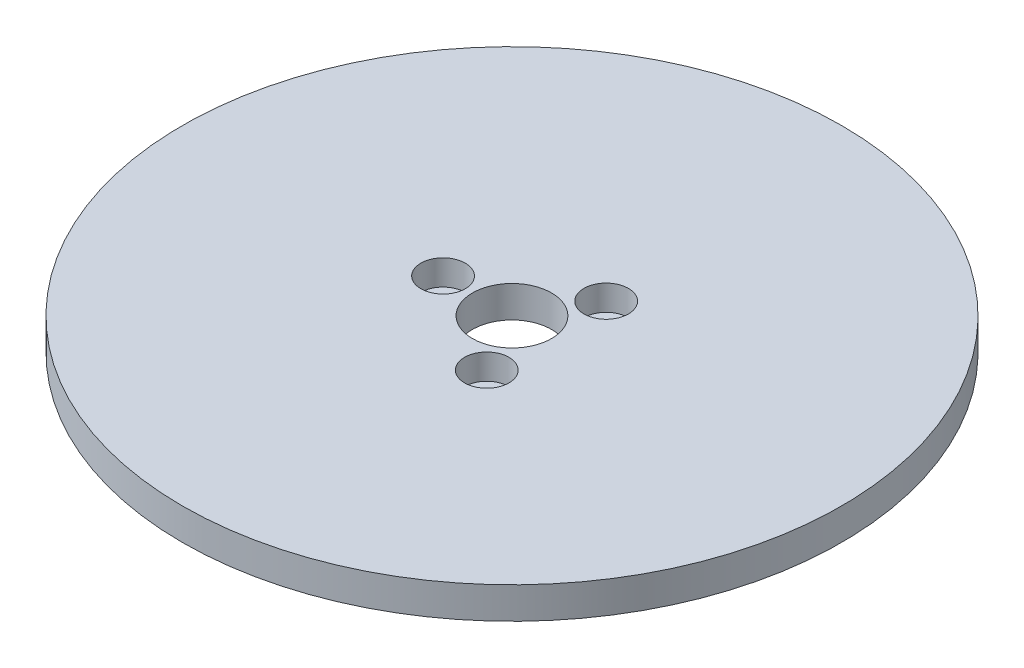
ISO-10303-21;
HEADER;
FILE_DESCRIPTION(('STEP AP214'),'2;1');
FILE_NAME('part.step','',(''),(''),'','','');
FILE_SCHEMA(('AUTOMOTIVE_DESIGN { 1 0 10303 214 1 1 1 1 }'));
ENDSEC;
DATA;
#1=APPLICATION_CONTEXT('core data for automotive mechanical design processes');
#2=APPLICATION_PROTOCOL_DEFINITION('international standard','automotive_design',2000,#1);
#3=PRODUCT_CONTEXT('',#1,'mechanical');
#4=PRODUCT('Part','Part','',(#3));
#5=PRODUCT_RELATED_PRODUCT_CATEGORY('part','',(#4));
#6=PRODUCT_DEFINITION_FORMATION('','',#4);
#7=PRODUCT_DEFINITION_CONTEXT('part definition',#1,'design');
#8=PRODUCT_DEFINITION('design','',#6,#7);
#9=PRODUCT_DEFINITION_SHAPE('','',#8);
#10=(LENGTH_UNIT() NAMED_UNIT(*) SI_UNIT(.MILLI.,.METRE.));
#11=(NAMED_UNIT(*) PLANE_ANGLE_UNIT() SI_UNIT($,.RADIAN.));
#12=(NAMED_UNIT(*) SI_UNIT($,.STERADIAN.) SOLID_ANGLE_UNIT());
#13=UNCERTAINTY_MEASURE_WITH_UNIT(LENGTH_MEASURE(1.E-05),#10,'distance_accuracy_value','');
#14=(GEOMETRIC_REPRESENTATION_CONTEXT(3) GLOBAL_UNCERTAINTY_ASSIGNED_CONTEXT((#13)) GLOBAL_UNIT_ASSIGNED_CONTEXT((#10,
#11,#12)) REPRESENTATION_CONTEXT('',''));
#15=CARTESIAN_POINT('',(0.,0.,0.));
#16=DIRECTION('',(0.,0.,1.));
#17=DIRECTION('',(1.,0.,0.));
#18=AXIS2_PLACEMENT_3D('',#15,#16,#17);
#19=CARTESIAN_POINT('',(0.,6.,0.));
#20=DIRECTION('',(0.,-1.,0.));
#21=DIRECTION('',(0.,0.,-1.));
#22=AXIS2_PLACEMENT_3D('',#19,#20,#21);
#23=CYLINDRICAL_SURFACE('',#22,62.5);
#24=CARTESIAN_POINT('',(0.,6.,0.));
#25=DIRECTION('',(0.,1.,0.));
#26=DIRECTION('',(0.,0.,1.));
#27=AXIS2_PLACEMENT_3D('',#24,#25,#26);
#28=CIRCLE('',#27,62.5);
#29=CARTESIAN_POINT('',(0.,6.,62.5));
#30=VERTEX_POINT('',#29);
#31=EDGE_CURVE('E10',#30,#30,#28,.T.);
#32=ORIENTED_EDGE('',*,*,#31,.F.);
#33=EDGE_LOOP('',(#32));
#34=FACE_BOUND('',#33,.T.);
#35=CARTESIAN_POINT('',(0.,0.,0.));
#36=DIRECTION('',(0.,1.,0.));
#37=DIRECTION('',(0.,0.,1.));
#38=AXIS2_PLACEMENT_3D('',#35,#36,#37);
#39=CIRCLE('',#38,62.5);
#40=CARTESIAN_POINT('',(0.,0.,62.5));
#41=VERTEX_POINT('',#40);
#42=EDGE_CURVE('E37',#41,#41,#39,.T.);
#43=ORIENTED_EDGE('',*,*,#42,.T.);
#44=EDGE_LOOP('',(#43));
#45=FACE_BOUND('',#44,.T.);
#46=ADVANCED_FACE('F40',(#34,#45),#23,.T.);
#47=CARTESIAN_POINT('',(0.,6.,0.));
#48=DIRECTION('',(0.,1.,0.));
#49=DIRECTION('',(0.,0.,1.));
#50=AXIS2_PLACEMENT_3D('',#47,#48,#49);
#51=PLANE('',#50);
#52=CARTESIAN_POINT('',(6.53649974136632,6.,11.3215496557072));
#53=DIRECTION('',(0.,1.,0.));
#54=DIRECTION('',(0.866025403784436,0.,-0.500000000000004));
#55=AXIS2_PLACEMENT_3D('',#52,#53,#54);
#56=CIRCLE('',#55,4.21314802739618);
#57=CARTESIAN_POINT('',(10.1851929629957,6.,9.21497564200907));
#58=VERTEX_POINT('',#57);
#59=EDGE_CURVE('E70',#58,#58,#56,.T.);
#60=ORIENTED_EDGE('',*,*,#59,.F.);
#61=EDGE_LOOP('',(#60));
#62=FACE_BOUND('',#61,.T.);
#63=CARTESIAN_POINT('',(6.53649974136617,6.,-11.3215496557073));
#64=DIRECTION('',(0.,1.,0.));
#65=DIRECTION('',(-0.866025403784443,0.,-0.499999999999992));
#66=AXIS2_PLACEMENT_3D('',#63,#64,#65);
#67=CIRCLE('',#66,4.21314802739618);
#68=CARTESIAN_POINT('',(2.88780651973676,6.,-13.4281236694053));
#69=VERTEX_POINT('',#68);
#70=EDGE_CURVE('E61',#69,#69,#67,.T.);
#71=ORIENTED_EDGE('',*,*,#70,.F.);
#72=EDGE_LOOP('',(#71));
#73=FACE_BOUND('',#72,.T.);
#74=CARTESIAN_POINT('',(-13.0729994827325,6.,0.));
#75=DIRECTION('',(0.,1.,0.));
#76=DIRECTION('',(0.,0.,1.));
#77=AXIS2_PLACEMENT_3D('',#74,#75,#76);
#78=CIRCLE('',#77,4.21314802739618);
#79=CARTESIAN_POINT('',(-13.0729994827325,6.,4.21314802739618));
#80=VERTEX_POINT('',#79);
#81=EDGE_CURVE('E54',#80,#80,#78,.T.);
#82=ORIENTED_EDGE('',*,*,#81,.F.);
#83=EDGE_LOOP('',(#82));
#84=FACE_BOUND('',#83,.T.);
#85=CARTESIAN_POINT('',(0.,6.,0.));
#86=DIRECTION('',(0.,1.,0.));
#87=DIRECTION('',(0.,0.,1.));
#88=AXIS2_PLACEMENT_3D('',#85,#86,#87);
#89=CIRCLE('',#88,7.5);
#90=CARTESIAN_POINT('',(0.,6.,7.5));
#91=VERTEX_POINT('',#90);
#92=EDGE_CURVE('E50',#91,#91,#89,.T.);
#93=ORIENTED_EDGE('',*,*,#92,.F.);
#94=EDGE_LOOP('',(#93));
#95=FACE_BOUND('',#94,.T.);
#96=ORIENTED_EDGE('',*,*,#31,.T.);
#97=EDGE_LOOP('',(#96));
#98=FACE_BOUND('',#97,.T.);
#99=ADVANCED_FACE('F85',(#62,#73,#84,#95,#98),#51,.T.);
#100=CARTESIAN_POINT('',(0.,0.,0.));
#101=DIRECTION('',(0.,1.,0.));
#102=DIRECTION('',(0.,0.,1.));
#103=AXIS2_PLACEMENT_3D('',#100,#101,#102);
#104=PLANE('',#103);
#105=CARTESIAN_POINT('',(0.,0.,0.));
#106=DIRECTION('',(0.,1.,0.));
#107=DIRECTION('',(0.,0.,1.));
#108=AXIS2_PLACEMENT_3D('',#105,#106,#107);
#109=CIRCLE('',#108,7.5);
#110=CARTESIAN_POINT('',(0.,0.,7.5));
#111=VERTEX_POINT('',#110);
#112=EDGE_CURVE('E47',#111,#111,#109,.T.);
#113=ORIENTED_EDGE('',*,*,#112,.T.);
#114=EDGE_LOOP('',(#113));
#115=FACE_BOUND('',#114,.T.);
#116=ORIENTED_EDGE('',*,*,#42,.F.);
#117=EDGE_LOOP('',(#116));
#118=FACE_BOUND('',#117,.T.);
#119=ADVANCED_FACE('F84',(#115,#118),#104,.F.);
#120=CARTESIAN_POINT('',(0.,6.,0.));
#121=DIRECTION('',(0.,-1.,0.));
#122=DIRECTION('',(0.,0.,-1.));
#123=AXIS2_PLACEMENT_3D('',#120,#121,#122);
#124=CYLINDRICAL_SURFACE('',#123,7.5);
#125=ORIENTED_EDGE('',*,*,#92,.T.);
#126=EDGE_LOOP('',(#125));
#127=FACE_BOUND('',#126,.T.);
#128=ORIENTED_EDGE('',*,*,#112,.F.);
#129=EDGE_LOOP('',(#128));
#130=FACE_BOUND('',#129,.T.);
#131=ADVANCED_FACE('F91',(#127,#130),#124,.F.);
#132=CARTESIAN_POINT('',(-13.0729994827325,1.1893817955355,0.));
#133=DIRECTION('',(0.,1.,0.));
#134=DIRECTION('',(0.,0.,1.));
#135=AXIS2_PLACEMENT_3D('',#132,#133,#134);
#136=CYLINDRICAL_SURFACE('',#135,4.21314802739618);
#137=CARTESIAN_POINT('',(-13.0729994827325,1.1893817955355,0.));
#138=DIRECTION('',(0.,1.,0.));
#139=DIRECTION('',(0.,0.,1.));
#140=AXIS2_PLACEMENT_3D('',#137,#138,#139);
#141=CIRCLE('',#140,4.21314802739618);
#142=CARTESIAN_POINT('',(-13.0729994827325,1.1893817955355,4.21314802739618));
#143=VERTEX_POINT('',#142);
#144=EDGE_CURVE('E55',#143,#143,#141,.T.);
#145=ORIENTED_EDGE('',*,*,#144,.F.);
#146=EDGE_LOOP('',(#145));
#147=FACE_BOUND('',#146,.T.);
#148=ORIENTED_EDGE('',*,*,#81,.T.);
#149=EDGE_LOOP('',(#148));
#150=FACE_BOUND('',#149,.T.);
#151=ADVANCED_FACE('F96',(#147,#150),#136,.F.);
#152=CARTESIAN_POINT('',(-13.0729994827325,1.1893817955355,0.));
#153=DIRECTION('',(0.,1.,0.));
#154=DIRECTION('',(0.,0.,1.));
#155=AXIS2_PLACEMENT_3D('',#152,#153,#154);
#156=PLANE('',#155);
#157=ORIENTED_EDGE('',*,*,#144,.T.);
#158=EDGE_LOOP('',(#157));
#159=FACE_BOUND('',#158,.T.);
#160=ADVANCED_FACE('F127',(#159),#156,.T.);
#161=CARTESIAN_POINT('',(6.53649974136617,1.1893817955355,-11.3215496557073));
#162=DIRECTION('',(0.,1.,0.));
#163=DIRECTION('',(0.,0.,1.));
#164=AXIS2_PLACEMENT_3D('',#161,#162,#163);
#165=CYLINDRICAL_SURFACE('',#164,4.21314802739618);
#166=CARTESIAN_POINT('',(6.53649974136617,1.1893817955355,-11.3215496557073));
#167=DIRECTION('',(0.,1.,0.));
#168=DIRECTION('',(-0.866025403784443,0.,-0.499999999999992));
#169=AXIS2_PLACEMENT_3D('',#166,#167,#168);
#170=CIRCLE('',#169,4.21314802739618);
#171=CARTESIAN_POINT('',(2.88780651973676,1.1893817955355,-13.4281236694053));
#172=VERTEX_POINT('',#171);
#173=EDGE_CURVE('E63',#172,#172,#170,.T.);
#174=ORIENTED_EDGE('',*,*,#173,.F.);
#175=EDGE_LOOP('',(#174));
#176=FACE_BOUND('',#175,.T.);
#177=ORIENTED_EDGE('',*,*,#70,.T.);
#178=EDGE_LOOP('',(#177));
#179=FACE_BOUND('',#178,.T.);
#180=ADVANCED_FACE('F133',(#176,#179),#165,.F.);
#181=CARTESIAN_POINT('',(6.53649974136617,1.1893817955355,-11.3215496557073));
#182=DIRECTION('',(0.,1.,0.));
#183=DIRECTION('',(-0.866025403784443,0.,-0.499999999999992));
#184=AXIS2_PLACEMENT_3D('',#181,#182,#183);
#185=PLANE('',#184);
#186=ORIENTED_EDGE('',*,*,#173,.T.);
#187=EDGE_LOOP('',(#186));
#188=FACE_BOUND('',#187,.T.);
#189=ADVANCED_FACE('F77',(#188),#185,.T.);
#190=CARTESIAN_POINT('',(6.53649974136632,1.1893817955355,11.3215496557072));
#191=DIRECTION('',(0.,1.,0.));
#192=DIRECTION('',(0.,0.,1.));
#193=AXIS2_PLACEMENT_3D('',#190,#191,#192);
#194=CYLINDRICAL_SURFACE('',#193,4.21314802739618);
#195=CARTESIAN_POINT('',(6.53649974136632,1.1893817955355,11.3215496557072));
#196=DIRECTION('',(0.,1.,0.));
#197=DIRECTION('',(0.866025403784436,0.,-0.500000000000004));
#198=AXIS2_PLACEMENT_3D('',#195,#196,#197);
#199=CIRCLE('',#198,4.21314802739618);
#200=CARTESIAN_POINT('',(10.1851929629957,1.1893817955355,9.21497564200907));
#201=VERTEX_POINT('',#200);
#202=EDGE_CURVE('E59',#201,#201,#199,.T.);
#203=ORIENTED_EDGE('',*,*,#202,.F.);
#204=EDGE_LOOP('',(#203));
#205=FACE_BOUND('',#204,.T.);
#206=ORIENTED_EDGE('',*,*,#59,.T.);
#207=EDGE_LOOP('',(#206));
#208=FACE_BOUND('',#207,.T.);
#209=ADVANCED_FACE('F73',(#205,#208),#194,.F.);
#210=CARTESIAN_POINT('',(6.53649974136632,1.1893817955355,11.3215496557072));
#211=DIRECTION('',(0.,1.,0.));
#212=DIRECTION('',(0.866025403784436,0.,-0.500000000000004));
#213=AXIS2_PLACEMENT_3D('',#210,#211,#212);
#214=PLANE('',#213);
#215=ORIENTED_EDGE('',*,*,#202,.T.);
#216=EDGE_LOOP('',(#215));
#217=FACE_BOUND('',#216,.T.);
#218=ADVANCED_FACE('F71',(#217),#214,.T.);
#219=CLOSED_SHELL('',(#46,#99,#119,#131,#151,#160,#180,#189,#209,#218));
#220=MANIFOLD_SOLID_BREP('B2',#219);
#221=ADVANCED_BREP_SHAPE_REPRESENTATION('',(#18,#220),#14);
#222=SHAPE_DEFINITION_REPRESENTATION(#9,#221);
ENDSEC;
END-ISO-10303-21;
